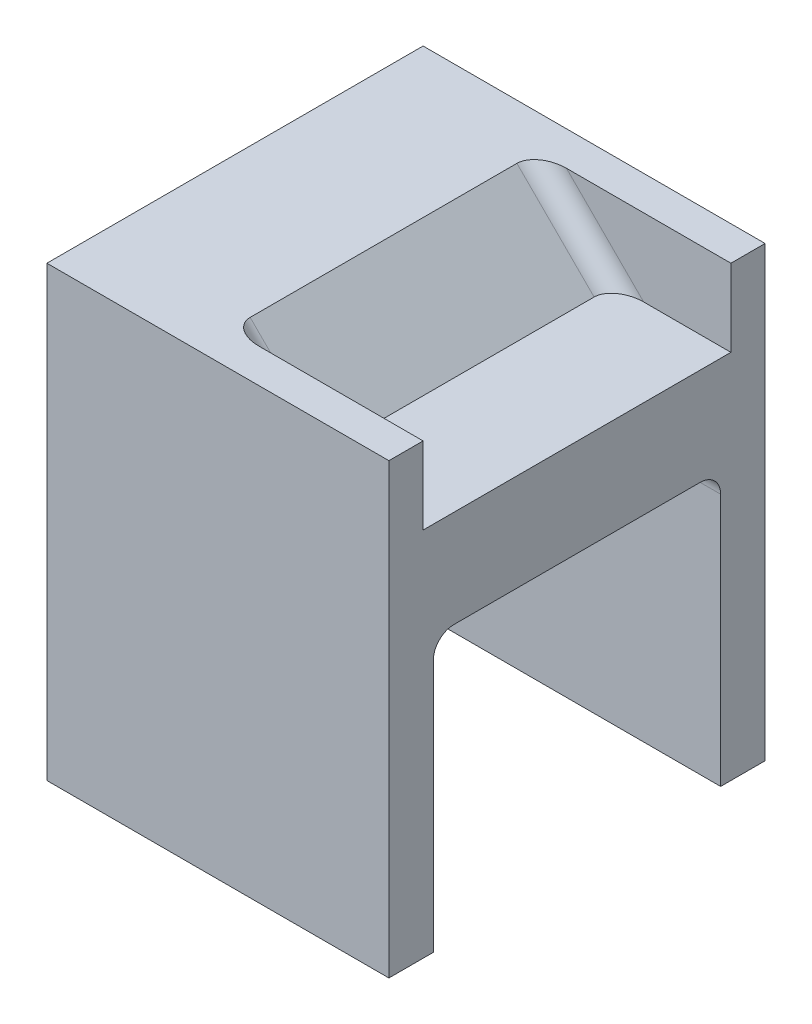
ISO-10303-21;
HEADER;
FILE_DESCRIPTION(('STEP AP214'),'2;1');
FILE_NAME('part.step','',(''),(''),'','','');
FILE_SCHEMA(('AUTOMOTIVE_DESIGN { 1 0 10303 214 1 1 1 1 }'));
ENDSEC;
DATA;
#1=APPLICATION_CONTEXT('core data for automotive mechanical design processes');
#2=APPLICATION_PROTOCOL_DEFINITION('international standard','automotive_design',2000,#1);
#3=PRODUCT_CONTEXT('',#1,'mechanical');
#4=PRODUCT('Part','Part','',(#3));
#5=PRODUCT_RELATED_PRODUCT_CATEGORY('part','',(#4));
#6=PRODUCT_DEFINITION_FORMATION('','',#4);
#7=PRODUCT_DEFINITION_CONTEXT('part definition',#1,'design');
#8=PRODUCT_DEFINITION('design','',#6,#7);
#9=PRODUCT_DEFINITION_SHAPE('','',#8);
#10=(LENGTH_UNIT() NAMED_UNIT(*) SI_UNIT(.MILLI.,.METRE.));
#11=(NAMED_UNIT(*) PLANE_ANGLE_UNIT() SI_UNIT($,.RADIAN.));
#12=(NAMED_UNIT(*) SI_UNIT($,.STERADIAN.) SOLID_ANGLE_UNIT());
#13=UNCERTAINTY_MEASURE_WITH_UNIT(LENGTH_MEASURE(1.E-05),#10,'distance_accuracy_value','');
#14=(GEOMETRIC_REPRESENTATION_CONTEXT(3) GLOBAL_UNCERTAINTY_ASSIGNED_CONTEXT((#13)) GLOBAL_UNIT_ASSIGNED_CONTEXT((#10,
#11,#12)) REPRESENTATION_CONTEXT('',''));
#15=CARTESIAN_POINT('',(0.,0.,0.));
#16=DIRECTION('',(0.,0.,1.));
#17=DIRECTION('',(1.,0.,0.));
#18=AXIS2_PLACEMENT_3D('',#15,#16,#17);
#19=CARTESIAN_POINT('',(0.,14.2160000000002,27.5));
#20=DIRECTION('',(0.,1.,0.));
#21=DIRECTION('',(0.,0.,1.));
#22=AXIS2_PLACEMENT_3D('',#19,#20,#21);
#23=PLANE('',#22);
#24=CARTESIAN_POINT('',(-12.757647994381,14.2160000000002,-19.5));
#25=DIRECTION('',(0.,1.,0.));
#26=DIRECTION('',(1.,0.,0.));
#27=AXIS2_PLACEMENT_3D('',#24,#25,#26);
#28=ELLIPSE('',#27,4.2426232508512,3.);
#29=CARTESIAN_POINT('',(-12.7576479943809,14.2160000000002,-22.5));
#30=VERTEX_POINT('',#29);
#31=CARTESIAN_POINT('',(-17.0002712452322,14.2160000000002,-19.5));
#32=VERTEX_POINT('',#31);
#33=EDGE_CURVE('E20',#30,#32,#28,.T.);
#34=ORIENTED_EDGE('',*,*,#33,.T.);
#35=DIRECTION('',(0.,0.,1.));
#36=VECTOR('',#35,1.);
#37=CARTESIAN_POINT('',(-17.0002712452322,14.2160000000002,0.));
#38=LINE('',#37,#36);
#39=CARTESIAN_POINT('',(-17.0002712452321,14.2160000000002,19.5));
#40=VERTEX_POINT('',#39);
#41=EDGE_CURVE('E132',#40,#32,#38,.F.);
#42=ORIENTED_EDGE('',*,*,#41,.F.);
#43=CARTESIAN_POINT('',(-12.7576479943809,14.2160000000002,19.5));
#44=DIRECTION('',(0.,1.,0.));
#45=DIRECTION('',(-1.,0.,0.));
#46=AXIS2_PLACEMENT_3D('',#43,#44,#45);
#47=ELLIPSE('',#46,4.2426232508512,3.);
#48=CARTESIAN_POINT('',(-12.757647994381,14.2160000000002,22.5));
#49=VERTEX_POINT('',#48);
#50=EDGE_CURVE('E181',#40,#49,#47,.T.);
#51=ORIENTED_EDGE('',*,*,#50,.T.);
#52=DIRECTION('',(1.,0.,0.));
#53=VECTOR('',#52,1.);
#54=CARTESIAN_POINT('',(0.,14.2160000000002,22.5));
#55=LINE('',#54,#53);
#56=CARTESIAN_POINT('',(0.,14.2160000000002,22.5));
#57=VERTEX_POINT('',#56);
#58=EDGE_CURVE('E182',#57,#49,#55,.F.);
#59=ORIENTED_EDGE('',*,*,#58,.F.);
#60=DIRECTION('',(0.,0.,-1.));
#61=VECTOR('',#60,1.);
#62=CARTESIAN_POINT('',(0.,14.2160000000002,0.));
#63=LINE('',#62,#61);
#64=CARTESIAN_POINT('',(0.,14.2160000000002,-22.5));
#65=VERTEX_POINT('',#64);
#66=EDGE_CURVE('E203',#65,#57,#63,.F.);
#67=ORIENTED_EDGE('',*,*,#66,.F.);
#68=DIRECTION('',(1.,0.,0.));
#69=VECTOR('',#68,1.);
#70=CARTESIAN_POINT('',(-50.,14.2160000000002,-22.5));
#71=LINE('',#70,#69);
#72=EDGE_CURVE('E127',#30,#65,#71,.T.);
#73=ORIENTED_EDGE('',*,*,#72,.F.);
#74=EDGE_LOOP('',(#34,#42,#51,#59,#67,#73));
#75=FACE_BOUND('',#74,.T.);
#76=ADVANCED_FACE('F17',(#75),#23,.T.);
#77=CARTESIAN_POINT('',(0.,-3.,-18.));
#78=DIRECTION('',(1.,0.,0.));
#79=DIRECTION('',(0.,0.,-1.));
#80=AXIS2_PLACEMENT_3D('',#77,#78,#79);
#81=CYLINDRICAL_SURFACE('',#80,3.);
#82=DIRECTION('',(1.,0.,0.));
#83=VECTOR('',#82,1.);
#84=CARTESIAN_POINT('',(0.,-3.,-21.));
#85=LINE('',#84,#83);
#86=CARTESIAN_POINT('',(0.,-3.,-21.));
#87=VERTEX_POINT('',#86);
#88=CARTESIAN_POINT('',(-40.,-3.,-21.));
#89=VERTEX_POINT('',#88);
#90=EDGE_CURVE('E207',#87,#89,#85,.F.);
#91=ORIENTED_EDGE('',*,*,#90,.F.);
#92=CARTESIAN_POINT('',(0.,-3.,-18.));
#93=DIRECTION('',(1.,0.,0.));
#94=DIRECTION('',(0.,0.,-1.));
#95=AXIS2_PLACEMENT_3D('',#92,#93,#94);
#96=CIRCLE('',#95,3.);
#97=CARTESIAN_POINT('',(0.,0.,-18.));
#98=VERTEX_POINT('',#97);
#99=EDGE_CURVE('E174',#98,#87,#96,.F.);
#100=ORIENTED_EDGE('',*,*,#99,.F.);
#101=DIRECTION('',(1.,0.,0.));
#102=VECTOR('',#101,1.);
#103=CARTESIAN_POINT('',(0.,0.,-18.));
#104=LINE('',#103,#102);
#105=CARTESIAN_POINT('',(-40.,0.,-18.));
#106=VERTEX_POINT('',#105);
#107=EDGE_CURVE('E230',#106,#98,#104,.T.);
#108=ORIENTED_EDGE('',*,*,#107,.F.);
#109=CARTESIAN_POINT('',(-40.,-3.,-18.));
#110=DIRECTION('',(1.,0.,0.));
#111=DIRECTION('',(0.,0.,-1.));
#112=AXIS2_PLACEMENT_3D('',#109,#110,#111);
#113=CIRCLE('',#112,3.);
#114=EDGE_CURVE('E170',#89,#106,#113,.T.);
#115=ORIENTED_EDGE('',*,*,#114,.F.);
#116=EDGE_LOOP('',(#91,#100,#108,#115));
#117=FACE_BOUND('',#116,.T.);
#118=ADVANCED_FACE('F358',(#117),#81,.F.);
#119=CARTESIAN_POINT('',(0.,0.,-27.5));
#120=DIRECTION('',(0.,-1.,0.));
#121=DIRECTION('',(0.,0.,-1.));
#122=AXIS2_PLACEMENT_3D('',#119,#120,#121);
#123=PLANE('',#122);
#124=DIRECTION('',(-1.,0.,0.));
#125=VECTOR('',#124,1.);
#126=CARTESIAN_POINT('',(-20.,0.,18.));
#127=LINE('',#126,#125);
#128=CARTESIAN_POINT('',(0.,0.,18.));
#129=VERTEX_POINT('',#128);
#130=CARTESIAN_POINT('',(-40.,0.,18.));
#131=VERTEX_POINT('',#130);
#132=EDGE_CURVE('E228',#129,#131,#127,.T.);
#133=ORIENTED_EDGE('',*,*,#132,.T.);
#134=DIRECTION('',(0.,0.,-1.));
#135=VECTOR('',#134,1.);
#136=CARTESIAN_POINT('',(-40.,0.,-21.));
#137=LINE('',#136,#135);
#138=EDGE_CURVE('E169',#106,#131,#137,.F.);
#139=ORIENTED_EDGE('',*,*,#138,.F.);
#140=ORIENTED_EDGE('',*,*,#107,.T.);
#141=DIRECTION('',(0.,0.,-1.));
#142=VECTOR('',#141,1.);
#143=CARTESIAN_POINT('',(0.,0.,0.));
#144=LINE('',#143,#142);
#145=EDGE_CURVE('E177',#129,#98,#144,.T.);
#146=ORIENTED_EDGE('',*,*,#145,.F.);
#147=EDGE_LOOP('',(#133,#139,#140,#146));
#148=FACE_BOUND('',#147,.T.);
#149=ADVANCED_FACE('F362',(#148),#123,.T.);
#150=CARTESIAN_POINT('',(-20.,-3.00000000000001,18.));
#151=DIRECTION('',(-1.,0.,0.));
#152=DIRECTION('',(0.,0.,1.));
#153=AXIS2_PLACEMENT_3D('',#150,#151,#152);
#154=CYLINDRICAL_SURFACE('',#153,3.);
#155=ORIENTED_EDGE('',*,*,#132,.F.);
#156=CARTESIAN_POINT('',(0.,-3.00000000000001,18.));
#157=DIRECTION('',(-1.,0.,0.));
#158=DIRECTION('',(0.,0.,1.));
#159=AXIS2_PLACEMENT_3D('',#156,#157,#158);
#160=CIRCLE('',#159,3.);
#161=CARTESIAN_POINT('',(0.,-3.00000000000001,21.));
#162=VERTEX_POINT('',#161);
#163=EDGE_CURVE('E178',#162,#129,#160,.T.);
#164=ORIENTED_EDGE('',*,*,#163,.F.);
#165=DIRECTION('',(-1.,0.,0.));
#166=VECTOR('',#165,1.);
#167=CARTESIAN_POINT('',(-40.,-3.00000000000001,21.));
#168=LINE('',#167,#166);
#169=CARTESIAN_POINT('',(-40.,-3.00000000000001,21.));
#170=VERTEX_POINT('',#169);
#171=EDGE_CURVE('E204',#170,#162,#168,.F.);
#172=ORIENTED_EDGE('',*,*,#171,.F.);
#173=CARTESIAN_POINT('',(-40.,-3.00000000000001,18.));
#174=DIRECTION('',(-1.,0.,0.));
#175=DIRECTION('',(0.,0.,1.));
#176=AXIS2_PLACEMENT_3D('',#173,#174,#175);
#177=CIRCLE('',#176,3.);
#178=EDGE_CURVE('E165',#131,#170,#177,.F.);
#179=ORIENTED_EDGE('',*,*,#178,.F.);
#180=EDGE_LOOP('',(#155,#164,#172,#179));
#181=FACE_BOUND('',#180,.T.);
#182=ADVANCED_FACE('F366',(#181),#154,.F.);
#183=CARTESIAN_POINT('',(-50.,14.2160000000002,-22.5));
#184=DIRECTION('',(0.,0.,1.));
#185=DIRECTION('',(1.,0.,0.));
#186=AXIS2_PLACEMENT_3D('',#183,#184,#185);
#187=PLANE('',#186);
#188=ORIENTED_EDGE('',*,*,#72,.T.);
#189=DIRECTION('',(0.,1.,0.));
#190=VECTOR('',#189,1.);
#191=CARTESIAN_POINT('',(0.,7.10800000000011,-22.5));
#192=LINE('',#191,#190);
#193=CARTESIAN_POINT('',(0.,25.5000000000003,-22.5));
#194=VERTEX_POINT('',#193);
#195=EDGE_CURVE('E200',#194,#65,#192,.F.);
#196=ORIENTED_EDGE('',*,*,#195,.F.);
#197=DIRECTION('',(1.,0.,0.));
#198=VECTOR('',#197,1.);
#199=CARTESIAN_POINT('',(-50.,25.5000000000003,-22.5));
#200=LINE('',#199,#198);
#201=CARTESIAN_POINT('',(-24.0415552449507,25.5000000000003,-22.5));
#202=VERTEX_POINT('',#201);
#203=EDGE_CURVE('E164',#194,#202,#200,.F.);
#204=ORIENTED_EDGE('',*,*,#203,.T.);
#205=DIRECTION('',(0.70710387511798,-0.707109687243171,0.));
#206=VECTOR('',#205,1.);
#207=CARTESIAN_POINT('',(-23.1286709385067,24.5871081899941,-22.5));
#208=LINE('',#207,#206);
#209=EDGE_CURVE('E136',#202,#30,#208,.T.);
#210=ORIENTED_EDGE('',*,*,#209,.T.);
#211=EDGE_LOOP('',(#188,#196,#204,#210));
#212=FACE_BOUND('',#211,.T.);
#213=ADVANCED_FACE('F248',(#212),#187,.T.);
#214=CARTESIAN_POINT('',(-23.1286709385067,24.5871081899941,-19.5));
#215=DIRECTION('',(0.70710387511798,-0.707109687243171,0.));
#216=DIRECTION('',(0.707109687243171,0.70710387511798,0.));
#217=AXIS2_PLACEMENT_3D('',#214,#215,#216);
#218=CYLINDRICAL_SURFACE('',#217,3.);
#219=DIRECTION('',(-0.70710387511798,0.707109687243171,0.));
#220=VECTOR('',#219,1.);
#221=CARTESIAN_POINT('',(-16.9999999999151,14.2157287524536,-19.5));
#222=LINE('',#221,#220);
#223=CARTESIAN_POINT('',(-28.2841784958019,25.5000000000003,-19.5));
#224=VERTEX_POINT('',#223);
#225=EDGE_CURVE('E138',#32,#224,#222,.T.);
#226=ORIENTED_EDGE('',*,*,#225,.F.);
#227=ORIENTED_EDGE('',*,*,#33,.F.);
#228=ORIENTED_EDGE('',*,*,#209,.F.);
#229=CARTESIAN_POINT('',(-24.0415552449507,25.5000000000003,-19.5));
#230=DIRECTION('',(0.,-1.,0.));
#231=DIRECTION('',(1.,0.,0.));
#232=AXIS2_PLACEMENT_3D('',#229,#230,#231);
#233=ELLIPSE('',#232,4.2426232508512,3.);
#234=EDGE_CURVE('E141',#202,#224,#233,.F.);
#235=ORIENTED_EDGE('',*,*,#234,.T.);
#236=EDGE_LOOP('',(#226,#227,#228,#235));
#237=FACE_BOUND('',#236,.T.);
#238=ADVANCED_FACE('F139',(#237),#218,.F.);
#239=CARTESIAN_POINT('',(-16.9999999999151,14.2157287524536,0.));
#240=DIRECTION('',(0.707109687243171,0.70710387511798,0.));
#241=DIRECTION('',(-0.70710387511798,0.707109687243171,0.));
#242=AXIS2_PLACEMENT_3D('',#239,#240,#241);
#243=PLANE('',#242);
#244=ORIENTED_EDGE('',*,*,#41,.T.);
#245=ORIENTED_EDGE('',*,*,#225,.T.);
#246=DIRECTION('',(0.,0.,-1.));
#247=VECTOR('',#246,1.);
#248=CARTESIAN_POINT('',(-28.2841784958019,25.5000000000003,27.5));
#249=LINE('',#248,#247);
#250=CARTESIAN_POINT('',(-28.2841784958019,25.5000000000003,19.5));
#251=VERTEX_POINT('',#250);
#252=EDGE_CURVE('E162',#224,#251,#249,.F.);
#253=ORIENTED_EDGE('',*,*,#252,.T.);
#254=DIRECTION('',(-0.70710387511798,0.707109687243171,0.));
#255=VECTOR('',#254,1.);
#256=CARTESIAN_POINT('',(-12.7501027450646,9.96579656506246,19.5));
#257=LINE('',#256,#255);
#258=EDGE_CURVE('E144',#251,#40,#257,.F.);
#259=ORIENTED_EDGE('',*,*,#258,.T.);
#260=EDGE_LOOP('',(#244,#245,#253,#259));
#261=FACE_BOUND('',#260,.T.);
#262=ADVANCED_FACE('F146',(#261),#243,.T.);
#263=CARTESIAN_POINT('',(-10.6287736833351,12.0871081904164,19.5));
#264=DIRECTION('',(-0.70710387511798,0.707109687243171,0.));
#265=DIRECTION('',(-0.707109687243171,-0.70710387511798,0.));
#266=AXIS2_PLACEMENT_3D('',#263,#264,#265);
#267=CYLINDRICAL_SURFACE('',#266,3.);
#268=DIRECTION('',(-0.707103875117977,0.707109687243174,0.));
#269=VECTOR('',#268,1.);
#270=CARTESIAN_POINT('',(-12.757647994381,14.2160000000002,22.5));
#271=LINE('',#270,#269);
#272=CARTESIAN_POINT('',(-24.0415552449507,25.5000000000003,22.5));
#273=VERTEX_POINT('',#272);
#274=EDGE_CURVE('E185',#49,#273,#271,.T.);
#275=ORIENTED_EDGE('',*,*,#274,.F.);
#276=ORIENTED_EDGE('',*,*,#50,.F.);
#277=ORIENTED_EDGE('',*,*,#258,.F.);
#278=CARTESIAN_POINT('',(-24.0415552449507,25.5000000000003,19.5));
#279=DIRECTION('',(0.,-1.,0.));
#280=DIRECTION('',(-1.,0.,0.));
#281=AXIS2_PLACEMENT_3D('',#278,#279,#280);
#282=ELLIPSE('',#281,4.2426232508512,3.);
#283=EDGE_CURVE('E159',#251,#273,#282,.F.);
#284=ORIENTED_EDGE('',*,*,#283,.T.);
#285=EDGE_LOOP('',(#275,#276,#277,#284));
#286=FACE_BOUND('',#285,.T.);
#287=ADVANCED_FACE('F382',(#286),#267,.F.);
#288=CARTESIAN_POINT('',(0.,14.2160000000002,22.5));
#289=DIRECTION('',(0.,0.,-1.));
#290=DIRECTION('',(0.,1.,0.));
#291=AXIS2_PLACEMENT_3D('',#288,#289,#290);
#292=PLANE('',#291);
#293=ORIENTED_EDGE('',*,*,#58,.T.);
#294=ORIENTED_EDGE('',*,*,#274,.T.);
#295=DIRECTION('',(1.,0.,0.));
#296=VECTOR('',#295,1.);
#297=CARTESIAN_POINT('',(-50.,25.5000000000003,22.5));
#298=LINE('',#297,#296);
#299=CARTESIAN_POINT('',(0.,25.5000000000003,22.5));
#300=VERTEX_POINT('',#299);
#301=EDGE_CURVE('E161',#273,#300,#298,.T.);
#302=ORIENTED_EDGE('',*,*,#301,.T.);
#303=DIRECTION('',(0.,1.,0.));
#304=VECTOR('',#303,1.);
#305=CARTESIAN_POINT('',(0.,7.10800000000011,22.5));
#306=LINE('',#305,#304);
#307=EDGE_CURVE('E245',#57,#300,#306,.T.);
#308=ORIENTED_EDGE('',*,*,#307,.F.);
#309=EDGE_LOOP('',(#293,#294,#302,#308));
#310=FACE_BOUND('',#309,.T.);
#311=ADVANCED_FACE('F377',(#310),#292,.T.);
#312=CARTESIAN_POINT('',(0.,0.,-21.));
#313=DIRECTION('',(0.,0.,1.));
#314=DIRECTION('',(1.,0.,0.));
#315=AXIS2_PLACEMENT_3D('',#312,#313,#314);
#316=PLANE('',#315);
#317=DIRECTION('',(1.,0.,0.));
#318=VECTOR('',#317,1.);
#319=CARTESIAN_POINT('',(-29.4137931034483,-40.,-21.));
#320=LINE('',#319,#318);
#321=CARTESIAN_POINT('',(0.,-40.,-21.));
#322=VERTEX_POINT('',#321);
#323=CARTESIAN_POINT('',(-40.,-40.,-21.));
#324=VERTEX_POINT('',#323);
#325=EDGE_CURVE('E214',#322,#324,#320,.F.);
#326=ORIENTED_EDGE('',*,*,#325,.F.);
#327=DIRECTION('',(0.,1.,0.));
#328=VECTOR('',#327,1.);
#329=CARTESIAN_POINT('',(0.,7.10800000000011,-21.));
#330=LINE('',#329,#328);
#331=EDGE_CURVE('E173',#87,#322,#330,.F.);
#332=ORIENTED_EDGE('',*,*,#331,.F.);
#333=ORIENTED_EDGE('',*,*,#90,.T.);
#334=DIRECTION('',(0.,1.,0.));
#335=VECTOR('',#334,1.);
#336=CARTESIAN_POINT('',(-40.,0.,-21.));
#337=LINE('',#336,#335);
#338=EDGE_CURVE('E259',#324,#89,#337,.T.);
#339=ORIENTED_EDGE('',*,*,#338,.F.);
#340=EDGE_LOOP('',(#326,#332,#333,#339));
#341=FACE_BOUND('',#340,.T.);
#342=ADVANCED_FACE('F355',(#341),#316,.T.);
#343=CARTESIAN_POINT('',(-40.,0.,21.));
#344=DIRECTION('',(0.,0.,-1.));
#345=DIRECTION('',(-1.,0.,0.));
#346=AXIS2_PLACEMENT_3D('',#343,#344,#345);
#347=PLANE('',#346);
#348=DIRECTION('',(1.,0.,0.));
#349=VECTOR('',#348,1.);
#350=CARTESIAN_POINT('',(-29.4137931034483,-40.,21.));
#351=LINE('',#350,#349);
#352=CARTESIAN_POINT('',(-40.,-40.,21.));
#353=VERTEX_POINT('',#352);
#354=CARTESIAN_POINT('',(0.,-40.,21.));
#355=VERTEX_POINT('',#354);
#356=EDGE_CURVE('E213',#353,#355,#351,.T.);
#357=ORIENTED_EDGE('',*,*,#356,.F.);
#358=DIRECTION('',(0.,1.,0.));
#359=VECTOR('',#358,1.);
#360=CARTESIAN_POINT('',(-40.,0.,21.));
#361=LINE('',#360,#359);
#362=EDGE_CURVE('E168',#170,#353,#361,.F.);
#363=ORIENTED_EDGE('',*,*,#362,.F.);
#364=ORIENTED_EDGE('',*,*,#171,.T.);
#365=DIRECTION('',(0.,1.,0.));
#366=VECTOR('',#365,1.);
#367=CARTESIAN_POINT('',(0.,7.10800000000011,21.));
#368=LINE('',#367,#366);
#369=EDGE_CURVE('E180',#355,#162,#368,.T.);
#370=ORIENTED_EDGE('',*,*,#369,.F.);
#371=EDGE_LOOP('',(#357,#363,#364,#370));
#372=FACE_BOUND('',#371,.T.);
#373=ADVANCED_FACE('F368',(#372),#347,.T.);
#374=CARTESIAN_POINT('',(0.,7.10800000000011,0.));
#375=DIRECTION('',(1.,0.,0.));
#376=DIRECTION('',(0.,0.,-1.));
#377=AXIS2_PLACEMENT_3D('',#374,#375,#376);
#378=PLANE('',#377);
#379=DIRECTION('',(0.,0.,-1.));
#380=VECTOR('',#379,1.);
#381=CARTESIAN_POINT('',(0.,-40.,0.));
#382=LINE('',#381,#380);
#383=CARTESIAN_POINT('',(0.,-40.,-27.5));
#384=VERTEX_POINT('',#383);
#385=EDGE_CURVE('E219',#384,#322,#382,.F.);
#386=ORIENTED_EDGE('',*,*,#385,.F.);
#387=DIRECTION('',(0.,1.,0.));
#388=VECTOR('',#387,1.);
#389=CARTESIAN_POINT('',(0.,14.2160000000002,-27.5));
#390=LINE('',#389,#388);
#391=CARTESIAN_POINT('',(0.,25.5000000000003,-27.5));
#392=VERTEX_POINT('',#391);
#393=EDGE_CURVE('E234',#392,#384,#390,.F.);
#394=ORIENTED_EDGE('',*,*,#393,.F.);
#395=DIRECTION('',(0.,0.,-1.));
#396=VECTOR('',#395,1.);
#397=CARTESIAN_POINT('',(0.,25.5000000000003,27.5));
#398=LINE('',#397,#396);
#399=EDGE_CURVE('E193',#392,#194,#398,.F.);
#400=ORIENTED_EDGE('',*,*,#399,.T.);
#401=ORIENTED_EDGE('',*,*,#195,.T.);
#402=ORIENTED_EDGE('',*,*,#66,.T.);
#403=ORIENTED_EDGE('',*,*,#307,.T.);
#404=DIRECTION('',(0.,0.,-1.));
#405=VECTOR('',#404,1.);
#406=CARTESIAN_POINT('',(0.,25.5000000000003,27.5));
#407=LINE('',#406,#405);
#408=CARTESIAN_POINT('',(0.,25.5000000000003,27.5));
#409=VERTEX_POINT('',#408);
#410=EDGE_CURVE('E197',#300,#409,#407,.F.);
#411=ORIENTED_EDGE('',*,*,#410,.T.);
#412=DIRECTION('',(0.,1.,0.));
#413=VECTOR('',#412,1.);
#414=CARTESIAN_POINT('',(0.,0.,27.5));
#415=LINE('',#414,#413);
#416=CARTESIAN_POINT('',(0.,-40.,27.5));
#417=VERTEX_POINT('',#416);
#418=EDGE_CURVE('E158',#417,#409,#415,.T.);
#419=ORIENTED_EDGE('',*,*,#418,.F.);
#420=DIRECTION('',(0.,0.,-1.));
#421=VECTOR('',#420,1.);
#422=CARTESIAN_POINT('',(0.,-40.,0.));
#423=LINE('',#422,#421);
#424=EDGE_CURVE('E225',#355,#417,#423,.F.);
#425=ORIENTED_EDGE('',*,*,#424,.F.);
#426=ORIENTED_EDGE('',*,*,#369,.T.);
#427=ORIENTED_EDGE('',*,*,#163,.T.);
#428=ORIENTED_EDGE('',*,*,#145,.T.);
#429=ORIENTED_EDGE('',*,*,#99,.T.);
#430=ORIENTED_EDGE('',*,*,#331,.T.);
#431=EDGE_LOOP('',(#386,#394,#400,#401,#402,#403,#411,#419,#425,#426,#427,#428,#429,#430));
#432=FACE_BOUND('',#431,.T.);
#433=ADVANCED_FACE('F252',(#432),#378,.T.);
#434=CARTESIAN_POINT('',(-40.,0.,-21.));
#435=DIRECTION('',(1.,0.,0.));
#436=DIRECTION('',(0.,0.,-1.));
#437=AXIS2_PLACEMENT_3D('',#434,#435,#436);
#438=PLANE('',#437);
#439=CARTESIAN_POINT('',(-40.,-19.9999999999999,0.));
#440=DIRECTION('',(-1.,0.,0.));
#441=DIRECTION('',(0.,0.,1.));
#442=AXIS2_PLACEMENT_3D('',#439,#440,#441);
#443=CIRCLE('',#442,7.5);
#444=CARTESIAN_POINT('',(-40.,-19.9999999999999,7.5));
#445=VERTEX_POINT('',#444);
#446=EDGE_CURVE('E154',#445,#445,#443,.T.);
#447=ORIENTED_EDGE('',*,*,#446,.T.);
#448=EDGE_LOOP('',(#447));
#449=FACE_BOUND('',#448,.T.);
#450=DIRECTION('',(0.,0.,-1.));
#451=VECTOR('',#450,1.);
#452=CARTESIAN_POINT('',(-40.,-40.,0.));
#453=LINE('',#452,#451);
#454=EDGE_CURVE('E210',#324,#353,#453,.F.);
#455=ORIENTED_EDGE('',*,*,#454,.F.);
#456=ORIENTED_EDGE('',*,*,#338,.T.);
#457=ORIENTED_EDGE('',*,*,#114,.T.);
#458=ORIENTED_EDGE('',*,*,#138,.T.);
#459=ORIENTED_EDGE('',*,*,#178,.T.);
#460=ORIENTED_EDGE('',*,*,#362,.T.);
#461=EDGE_LOOP('',(#455,#456,#457,#458,#459,#460));
#462=FACE_BOUND('',#461,.T.);
#463=ADVANCED_FACE('F345',(#449,#462),#438,.T.);
#464=CARTESIAN_POINT('',(-50.,25.5000000000003,27.5));
#465=DIRECTION('',(0.,-1.,0.));
#466=DIRECTION('',(0.,0.,-1.));
#467=AXIS2_PLACEMENT_3D('',#464,#465,#466);
#468=PLANE('',#467);
#469=DIRECTION('',(1.,0.,0.));
#470=VECTOR('',#469,1.);
#471=CARTESIAN_POINT('',(0.,25.5000000000003,-27.5));
#472=LINE('',#471,#470);
#473=CARTESIAN_POINT('',(-50.,25.5000000000003,-27.5));
#474=VERTEX_POINT('',#473);
#475=EDGE_CURVE('E196',#474,#392,#472,.T.);
#476=ORIENTED_EDGE('',*,*,#475,.F.);
#477=DIRECTION('',(0.,0.,1.));
#478=VECTOR('',#477,1.);
#479=CARTESIAN_POINT('',(-50.,25.5000000000003,0.));
#480=LINE('',#479,#478);
#481=CARTESIAN_POINT('',(-50.,25.5000000000003,27.5));
#482=VERTEX_POINT('',#481);
#483=EDGE_CURVE('E157',#482,#474,#480,.F.);
#484=ORIENTED_EDGE('',*,*,#483,.F.);
#485=DIRECTION('',(1.,0.,0.));
#486=VECTOR('',#485,1.);
#487=CARTESIAN_POINT('',(0.,25.5000000000003,27.5));
#488=LINE('',#487,#486);
#489=EDGE_CURVE('E300',#409,#482,#488,.F.);
#490=ORIENTED_EDGE('',*,*,#489,.F.);
#491=ORIENTED_EDGE('',*,*,#410,.F.);
#492=ORIENTED_EDGE('',*,*,#301,.F.);
#493=ORIENTED_EDGE('',*,*,#283,.F.);
#494=ORIENTED_EDGE('',*,*,#252,.F.);
#495=ORIENTED_EDGE('',*,*,#234,.F.);
#496=ORIENTED_EDGE('',*,*,#203,.F.);
#497=ORIENTED_EDGE('',*,*,#399,.F.);
#498=EDGE_LOOP('',(#476,#484,#490,#491,#492,#493,#494,#495,#496,#497));
#499=FACE_BOUND('',#498,.T.);
#500=ADVANCED_FACE('F258',(#499),#468,.F.);
#501=CARTESIAN_POINT('',(0.,14.2160000000002,-27.5));
#502=DIRECTION('',(0.,0.,-1.));
#503=DIRECTION('',(0.,1.,0.));
#504=AXIS2_PLACEMENT_3D('',#501,#502,#503);
#505=PLANE('',#504);
#506=DIRECTION('',(1.,0.,0.));
#507=VECTOR('',#506,1.);
#508=CARTESIAN_POINT('',(-29.4137931034483,-40.,-27.5));
#509=LINE('',#508,#507);
#510=CARTESIAN_POINT('',(-50.,-40.,-27.5));
#511=VERTEX_POINT('',#510);
#512=EDGE_CURVE('E238',#511,#384,#509,.T.);
#513=ORIENTED_EDGE('',*,*,#512,.F.);
#514=DIRECTION('',(0.,1.,0.));
#515=VECTOR('',#514,1.);
#516=CARTESIAN_POINT('',(-50.,7.10800000000011,-27.5));
#517=LINE('',#516,#515);
#518=EDGE_CURVE('E308',#474,#511,#517,.F.);
#519=ORIENTED_EDGE('',*,*,#518,.F.);
#520=ORIENTED_EDGE('',*,*,#475,.T.);
#521=ORIENTED_EDGE('',*,*,#393,.T.);
#522=EDGE_LOOP('',(#513,#519,#520,#521));
#523=FACE_BOUND('',#522,.T.);
#524=ADVANCED_FACE('F321',(#523),#505,.T.);
#525=CARTESIAN_POINT('',(-29.4137931034483,-40.,0.));
#526=DIRECTION('',(0.,-1.,0.));
#527=DIRECTION('',(0.,0.,-1.));
#528=AXIS2_PLACEMENT_3D('',#525,#526,#527);
#529=PLANE('',#528);
#530=DIRECTION('',(0.,0.,1.));
#531=VECTOR('',#530,1.);
#532=CARTESIAN_POINT('',(-50.,-40.,0.));
#533=LINE('',#532,#531);
#534=CARTESIAN_POINT('',(-50.,-40.,27.5));
#535=VERTEX_POINT('',#534);
#536=EDGE_CURVE('E311',#511,#535,#533,.T.);
#537=ORIENTED_EDGE('',*,*,#536,.F.);
#538=ORIENTED_EDGE('',*,*,#512,.T.);
#539=ORIENTED_EDGE('',*,*,#385,.T.);
#540=ORIENTED_EDGE('',*,*,#325,.T.);
#541=ORIENTED_EDGE('',*,*,#454,.T.);
#542=ORIENTED_EDGE('',*,*,#356,.T.);
#543=ORIENTED_EDGE('',*,*,#424,.T.);
#544=DIRECTION('',(1.,0.,0.));
#545=VECTOR('',#544,1.);
#546=CARTESIAN_POINT('',(0.,-40.,27.5));
#547=LINE('',#546,#545);
#548=EDGE_CURVE('E35',#535,#417,#547,.T.);
#549=ORIENTED_EDGE('',*,*,#548,.F.);
#550=EDGE_LOOP('',(#537,#538,#539,#540,#541,#542,#543,#549));
#551=FACE_BOUND('',#550,.T.);
#552=ADVANCED_FACE('F322',(#551),#529,.T.);
#553=CARTESIAN_POINT('',(0.,0.,27.5));
#554=DIRECTION('',(0.,0.,1.));
#555=DIRECTION('',(1.,0.,0.));
#556=AXIS2_PLACEMENT_3D('',#553,#554,#555);
#557=PLANE('',#556);
#558=ORIENTED_EDGE('',*,*,#548,.T.);
#559=ORIENTED_EDGE('',*,*,#418,.T.);
#560=ORIENTED_EDGE('',*,*,#489,.T.);
#561=DIRECTION('',(0.,1.,0.));
#562=VECTOR('',#561,1.);
#563=CARTESIAN_POINT('',(-50.,7.10800000000011,27.5));
#564=LINE('',#563,#562);
#565=EDGE_CURVE('E26',#535,#482,#564,.T.);
#566=ORIENTED_EDGE('',*,*,#565,.F.);
#567=EDGE_LOOP('',(#558,#559,#560,#566));
#568=FACE_BOUND('',#567,.T.);
#569=ADVANCED_FACE('F318',(#568),#557,.T.);
#570=CARTESIAN_POINT('',(64.5933272751954,-19.9999999999999,0.));
#571=DIRECTION('',(-1.,0.,0.));
#572=DIRECTION('',(0.,0.,1.));
#573=AXIS2_PLACEMENT_3D('',#570,#571,#572);
#574=CYLINDRICAL_SURFACE('',#573,7.5);
#575=CARTESIAN_POINT('',(-50.,-19.9999999999999,0.));
#576=DIRECTION('',(-1.,0.,0.));
#577=DIRECTION('',(0.,0.,1.));
#578=AXIS2_PLACEMENT_3D('',#575,#576,#577);
#579=CIRCLE('',#578,7.5);
#580=CARTESIAN_POINT('',(-50.,-19.9999999999999,7.5));
#581=VERTEX_POINT('',#580);
#582=EDGE_CURVE('E11',#581,#581,#579,.F.);
#583=ORIENTED_EDGE('',*,*,#582,.F.);
#584=EDGE_LOOP('',(#583));
#585=FACE_BOUND('',#584,.T.);
#586=ORIENTED_EDGE('',*,*,#446,.F.);
#587=EDGE_LOOP('',(#586));
#588=FACE_BOUND('',#587,.T.);
#589=ADVANCED_FACE('F330',(#585,#588),#574,.F.);
#590=CARTESIAN_POINT('',(-50.,7.10800000000011,0.));
#591=DIRECTION('',(-1.,0.,0.));
#592=DIRECTION('',(0.,0.,1.));
#593=AXIS2_PLACEMENT_3D('',#590,#591,#592);
#594=PLANE('',#593);
#595=ORIENTED_EDGE('',*,*,#582,.T.);
#596=EDGE_LOOP('',(#595));
#597=FACE_BOUND('',#596,.T.);
#598=ORIENTED_EDGE('',*,*,#536,.T.);
#599=ORIENTED_EDGE('',*,*,#565,.T.);
#600=ORIENTED_EDGE('',*,*,#483,.T.);
#601=ORIENTED_EDGE('',*,*,#518,.T.);
#602=EDGE_LOOP('',(#598,#599,#600,#601));
#603=FACE_BOUND('',#602,.T.);
#604=ADVANCED_FACE('F316',(#597,#603),#594,.T.);
#605=CLOSED_SHELL('',(#76,#118,#149,#182,#213,#238,#262,#287,#311,#342,#373,#433,#463,#500,#524,
#552,#569,#589,#604));
#606=MANIFOLD_SOLID_BREP('B1',#605);
#607=ADVANCED_BREP_SHAPE_REPRESENTATION('',(#18,#606),#14);
#608=SHAPE_DEFINITION_REPRESENTATION(#9,#607);
ENDSEC;
END-ISO-10303-21;
